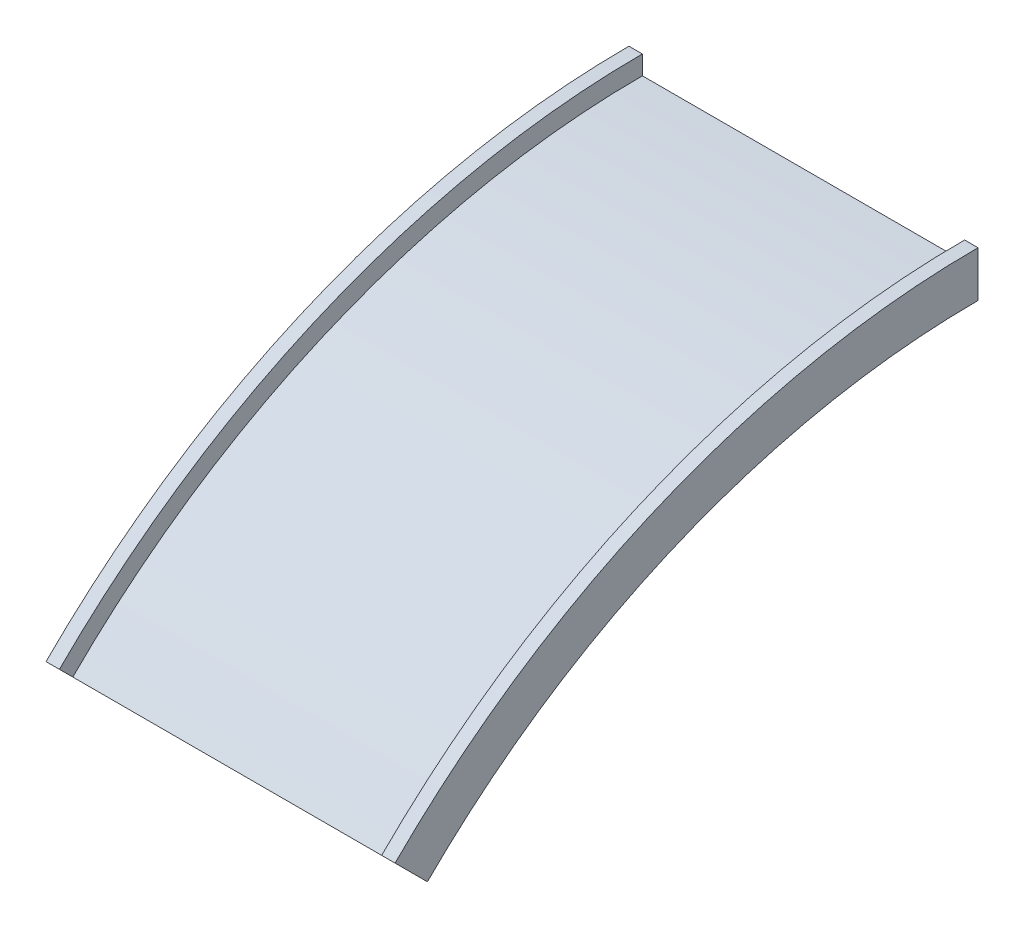
ISO-10303-21;
HEADER;
FILE_DESCRIPTION(('STEP AP214'),'2;1');
FILE_NAME('part.step','',(''),(''),'','','');
FILE_SCHEMA(('AUTOMOTIVE_DESIGN { 1 0 10303 214 1 1 1 1 }'));
ENDSEC;
DATA;
#1=APPLICATION_CONTEXT('core data for automotive mechanical design processes');
#2=APPLICATION_PROTOCOL_DEFINITION('international standard','automotive_design',2000,#1);
#3=PRODUCT_CONTEXT('',#1,'mechanical');
#4=PRODUCT('Part','Part','',(#3));
#5=PRODUCT_RELATED_PRODUCT_CATEGORY('part','',(#4));
#6=PRODUCT_DEFINITION_FORMATION('','',#4);
#7=PRODUCT_DEFINITION_CONTEXT('part definition',#1,'design');
#8=PRODUCT_DEFINITION('design','',#6,#7);
#9=PRODUCT_DEFINITION_SHAPE('','',#8);
#10=(LENGTH_UNIT() NAMED_UNIT(*) SI_UNIT(.MILLI.,.METRE.));
#11=(NAMED_UNIT(*) PLANE_ANGLE_UNIT() SI_UNIT($,.RADIAN.));
#12=(NAMED_UNIT(*) SI_UNIT($,.STERADIAN.) SOLID_ANGLE_UNIT());
#13=UNCERTAINTY_MEASURE_WITH_UNIT(LENGTH_MEASURE(1.E-05),#10,'distance_accuracy_value','');
#14=(GEOMETRIC_REPRESENTATION_CONTEXT(3) GLOBAL_UNCERTAINTY_ASSIGNED_CONTEXT((#13)) GLOBAL_UNIT_ASSIGNED_CONTEXT((#10,
#11,#12)) REPRESENTATION_CONTEXT('',''));
#15=CARTESIAN_POINT('',(0.,0.,0.));
#16=DIRECTION('',(0.,0.,1.));
#17=DIRECTION('',(1.,0.,0.));
#18=AXIS2_PLACEMENT_3D('',#15,#16,#17);
#19=CARTESIAN_POINT('',(25.,-449.660237621641,1085.57584412607));
#20=DIRECTION('',(1.,0.,0.));
#21=DIRECTION('',(0.,0.,-1.));
#22=AXIS2_PLACEMENT_3D('',#19,#20,#21);
#23=PLANE('',#22);
#24=CARTESIAN_POINT('',(25.,-1535.23608174771,0.));
#25=DIRECTION('',(-1.,0.,0.));
#26=DIRECTION('',(0.,0.,1.));
#27=AXIS2_PLACEMENT_3D('',#24,#25,#26);
#28=CIRCLE('',#27,1535.23608174771);
#29=CARTESIAN_POINT('',(25.,-449.660237621641,1085.57584412607));
#30=VERTEX_POINT('',#29);
#31=CARTESIAN_POINT('',(25.,0.,0.));
#32=VERTEX_POINT('',#31);
#33=EDGE_CURVE('E11',#30,#32,#28,.T.);
#34=ORIENTED_EDGE('',*,*,#33,.F.);
#35=DIRECTION('',(0.,-0.707106781186546,-0.707106781186549));
#36=VECTOR('',#35,1.);
#37=CARTESIAN_POINT('',(25.,-449.660237621641,1085.57584412607));
#38=LINE('',#37,#36);
#39=CARTESIAN_POINT('',(25.,-474.57590996789,1060.66017177982));
#40=VERTEX_POINT('',#39);
#41=EDGE_CURVE('E98',#30,#40,#38,.T.);
#42=ORIENTED_EDGE('',*,*,#41,.T.);
#43=CARTESIAN_POINT('',(25.,-1535.23608174771,0.));
#44=DIRECTION('',(-1.,0.,0.));
#45=DIRECTION('',(0.,0.,1.));
#46=AXIS2_PLACEMENT_3D('',#43,#44,#45);
#47=CIRCLE('',#46,1500.);
#48=CARTESIAN_POINT('',(25.,-35.2360817477097,0.));
#49=VERTEX_POINT('',#48);
#50=EDGE_CURVE('E93',#40,#49,#47,.T.);
#51=ORIENTED_EDGE('',*,*,#50,.T.);
#52=DIRECTION('',(0.,-1.,0.));
#53=VECTOR('',#52,1.);
#54=CARTESIAN_POINT('',(25.,0.,0.));
#55=LINE('',#54,#53);
#56=EDGE_CURVE('E96',#32,#49,#55,.T.);
#57=ORIENTED_EDGE('',*,*,#56,.F.);
#58=EDGE_LOOP('',(#34,#42,#51,#57));
#59=FACE_BOUND('',#58,.T.);
#60=ADVANCED_FACE('F33',(#59),#23,.T.);
#61=CARTESIAN_POINT('',(0.,-1535.23608174771,0.));
#62=DIRECTION('',(-1.,0.,0.));
#63=DIRECTION('',(0.,0.,1.));
#64=AXIS2_PLACEMENT_3D('',#61,#62,#63);
#65=CYLINDRICAL_SURFACE('',#64,1535.23608174771);
#66=CARTESIAN_POINT('',(0.,-1535.23608174771,0.));
#67=DIRECTION('',(-1.,0.,0.));
#68=DIRECTION('',(0.,0.,1.));
#69=AXIS2_PLACEMENT_3D('',#66,#67,#68);
#70=CIRCLE('',#69,1535.23608174771);
#71=CARTESIAN_POINT('',(0.,-449.660237621641,1085.57584412607));
#72=VERTEX_POINT('',#71);
#73=CARTESIAN_POINT('',(0.,0.,0.));
#74=VERTEX_POINT('',#73);
#75=EDGE_CURVE('E41',#72,#74,#70,.T.);
#76=ORIENTED_EDGE('',*,*,#75,.F.);
#77=DIRECTION('',(1.,0.,0.));
#78=VECTOR('',#77,1.);
#79=CARTESIAN_POINT('',(0.,-449.660237621641,1085.57584412607));
#80=LINE('',#79,#78);
#81=EDGE_CURVE('E103',#72,#30,#80,.T.);
#82=ORIENTED_EDGE('',*,*,#81,.T.);
#83=ORIENTED_EDGE('',*,*,#33,.T.);
#84=DIRECTION('',(1.,0.,0.));
#85=VECTOR('',#84,1.);
#86=CARTESIAN_POINT('',(0.,0.,0.));
#87=LINE('',#86,#85);
#88=EDGE_CURVE('E116',#74,#32,#87,.T.);
#89=ORIENTED_EDGE('',*,*,#88,.F.);
#90=EDGE_LOOP('',(#76,#82,#83,#89));
#91=FACE_BOUND('',#90,.T.);
#92=ADVANCED_FACE('F35',(#91),#65,.T.);
#93=CARTESIAN_POINT('',(0.,-509.931249027217,1025.3048327205));
#94=DIRECTION('',(-1.,0.,0.));
#95=DIRECTION('',(0.,0.,1.));
#96=AXIS2_PLACEMENT_3D('',#93,#94,#95);
#97=PLANE('',#96);
#98=CARTESIAN_POINT('',(0.,-1535.23608174771,0.));
#99=DIRECTION('',(-1.,0.,0.));
#100=DIRECTION('',(0.,0.,1.));
#101=AXIS2_PLACEMENT_3D('',#98,#99,#100);
#102=CIRCLE('',#101,1450.);
#103=CARTESIAN_POINT('',(0.,-509.931249027217,1025.3048327205));
#104=VERTEX_POINT('',#103);
#105=CARTESIAN_POINT('',(0.,-85.2360817477096,0.));
#106=VERTEX_POINT('',#105);
#107=EDGE_CURVE('E157',#104,#106,#102,.T.);
#108=ORIENTED_EDGE('',*,*,#107,.F.);
#109=DIRECTION('',(0.,0.707106781186546,0.707106781186549));
#110=VECTOR('',#109,1.);
#111=CARTESIAN_POINT('',(0.,-509.931249027217,1025.3048327205));
#112=LINE('',#111,#110);
#113=EDGE_CURVE('E147',#104,#72,#112,.T.);
#114=ORIENTED_EDGE('',*,*,#113,.T.);
#115=ORIENTED_EDGE('',*,*,#75,.T.);
#116=DIRECTION('',(0.,1.,0.));
#117=VECTOR('',#116,1.);
#118=CARTESIAN_POINT('',(0.,-85.2360817477096,0.));
#119=LINE('',#118,#117);
#120=EDGE_CURVE('E129',#106,#74,#119,.T.);
#121=ORIENTED_EDGE('',*,*,#120,.F.);
#122=EDGE_LOOP('',(#108,#114,#115,#121));
#123=FACE_BOUND('',#122,.T.);
#124=ADVANCED_FACE('F160',(#123),#97,.T.);
#125=CARTESIAN_POINT('',(0.,-1535.23608174771,0.));
#126=DIRECTION('',(-1.,0.,0.));
#127=DIRECTION('',(0.,0.,1.));
#128=AXIS2_PLACEMENT_3D('',#125,#126,#127);
#129=CYLINDRICAL_SURFACE('',#128,1450.);
#130=CARTESIAN_POINT('',(650.,-1535.23608174771,0.));
#131=DIRECTION('',(-1.,0.,0.));
#132=DIRECTION('',(0.,0.,1.));
#133=AXIS2_PLACEMENT_3D('',#130,#131,#132);
#134=CIRCLE('',#133,1450.);
#135=CARTESIAN_POINT('',(650.,-509.931249027218,1025.3048327205));
#136=VERTEX_POINT('',#135);
#137=CARTESIAN_POINT('',(650.,-85.2360817477097,0.));
#138=VERTEX_POINT('',#137);
#139=EDGE_CURVE('E155',#136,#138,#134,.T.);
#140=ORIENTED_EDGE('',*,*,#139,.F.);
#141=DIRECTION('',(-1.,0.,0.));
#142=VECTOR('',#141,1.);
#143=CARTESIAN_POINT('',(650.,-509.931249027218,1025.3048327205));
#144=LINE('',#143,#142);
#145=EDGE_CURVE('E144',#136,#104,#144,.T.);
#146=ORIENTED_EDGE('',*,*,#145,.T.);
#147=ORIENTED_EDGE('',*,*,#107,.T.);
#148=DIRECTION('',(-1.,0.,0.));
#149=VECTOR('',#148,1.);
#150=CARTESIAN_POINT('',(650.,-85.2360817477097,0.));
#151=LINE('',#150,#149);
#152=EDGE_CURVE('E126',#138,#106,#151,.T.);
#153=ORIENTED_EDGE('',*,*,#152,.F.);
#154=EDGE_LOOP('',(#140,#146,#147,#153));
#155=FACE_BOUND('',#154,.T.);
#156=ADVANCED_FACE('F179',(#155),#129,.F.);
#157=CARTESIAN_POINT('',(650.,-449.660237621641,1085.57584412607));
#158=DIRECTION('',(1.,0.,0.));
#159=DIRECTION('',(0.,0.,-1.));
#160=AXIS2_PLACEMENT_3D('',#157,#158,#159);
#161=PLANE('',#160);
#162=CARTESIAN_POINT('',(650.,-1535.23608174771,0.));
#163=DIRECTION('',(-1.,0.,0.));
#164=DIRECTION('',(0.,0.,1.));
#165=AXIS2_PLACEMENT_3D('',#162,#163,#164);
#166=CIRCLE('',#165,1535.23608174771);
#167=CARTESIAN_POINT('',(650.,-449.660237621641,1085.57584412607));
#168=VERTEX_POINT('',#167);
#169=CARTESIAN_POINT('',(650.,0.,0.));
#170=VERTEX_POINT('',#169);
#171=EDGE_CURVE('E153',#168,#170,#166,.T.);
#172=ORIENTED_EDGE('',*,*,#171,.F.);
#173=DIRECTION('',(0.,-0.707106781186546,-0.707106781186549));
#174=VECTOR('',#173,1.);
#175=CARTESIAN_POINT('',(650.,-449.660237621641,1085.57584412607));
#176=LINE('',#175,#174);
#177=EDGE_CURVE('E141',#168,#136,#176,.T.);
#178=ORIENTED_EDGE('',*,*,#177,.T.);
#179=ORIENTED_EDGE('',*,*,#139,.T.);
#180=DIRECTION('',(0.,-1.,0.));
#181=VECTOR('',#180,1.);
#182=CARTESIAN_POINT('',(650.,0.,0.));
#183=LINE('',#182,#181);
#184=EDGE_CURVE('E123',#170,#138,#183,.T.);
#185=ORIENTED_EDGE('',*,*,#184,.F.);
#186=EDGE_LOOP('',(#172,#178,#179,#185));
#187=FACE_BOUND('',#186,.T.);
#188=ADVANCED_FACE('F176',(#187),#161,.T.);
#189=CARTESIAN_POINT('',(0.,-1535.23608174771,0.));
#190=DIRECTION('',(-1.,0.,0.));
#191=DIRECTION('',(0.,0.,1.));
#192=AXIS2_PLACEMENT_3D('',#189,#190,#191);
#193=CYLINDRICAL_SURFACE('',#192,1535.23608174771);
#194=CARTESIAN_POINT('',(625.,-1535.23608174771,0.));
#195=DIRECTION('',(-1.,0.,0.));
#196=DIRECTION('',(0.,0.,1.));
#197=AXIS2_PLACEMENT_3D('',#194,#195,#196);
#198=CIRCLE('',#197,1535.23608174771);
#199=CARTESIAN_POINT('',(625.,-449.660237621641,1085.57584412607));
#200=VERTEX_POINT('',#199);
#201=CARTESIAN_POINT('',(625.,0.,0.));
#202=VERTEX_POINT('',#201);
#203=EDGE_CURVE('E151',#200,#202,#198,.T.);
#204=ORIENTED_EDGE('',*,*,#203,.F.);
#205=DIRECTION('',(1.,0.,0.));
#206=VECTOR('',#205,1.);
#207=CARTESIAN_POINT('',(625.,-449.660237621641,1085.57584412607));
#208=LINE('',#207,#206);
#209=EDGE_CURVE('E138',#200,#168,#208,.T.);
#210=ORIENTED_EDGE('',*,*,#209,.T.);
#211=ORIENTED_EDGE('',*,*,#171,.T.);
#212=DIRECTION('',(1.,0.,0.));
#213=VECTOR('',#212,1.);
#214=CARTESIAN_POINT('',(625.,0.,0.));
#215=LINE('',#214,#213);
#216=EDGE_CURVE('E120',#202,#170,#215,.T.);
#217=ORIENTED_EDGE('',*,*,#216,.F.);
#218=EDGE_LOOP('',(#204,#210,#211,#217));
#219=FACE_BOUND('',#218,.T.);
#220=ADVANCED_FACE('F174',(#219),#193,.T.);
#221=CARTESIAN_POINT('',(625.,-474.57590996789,1060.66017177982));
#222=DIRECTION('',(-1.,0.,0.));
#223=DIRECTION('',(0.,0.,1.));
#224=AXIS2_PLACEMENT_3D('',#221,#222,#223);
#225=PLANE('',#224);
#226=CARTESIAN_POINT('',(625.,-1535.23608174771,0.));
#227=DIRECTION('',(-1.,0.,0.));
#228=DIRECTION('',(0.,0.,1.));
#229=AXIS2_PLACEMENT_3D('',#226,#227,#228);
#230=CIRCLE('',#229,1500.);
#231=CARTESIAN_POINT('',(625.,-474.57590996789,1060.66017177982));
#232=VERTEX_POINT('',#231);
#233=CARTESIAN_POINT('',(625.,-35.2360817477097,0.));
#234=VERTEX_POINT('',#233);
#235=EDGE_CURVE('E102',#232,#234,#230,.T.);
#236=ORIENTED_EDGE('',*,*,#235,.F.);
#237=DIRECTION('',(0.,0.707106781186546,0.707106781186549));
#238=VECTOR('',#237,1.);
#239=CARTESIAN_POINT('',(625.,-474.57590996789,1060.66017177982));
#240=LINE('',#239,#238);
#241=EDGE_CURVE('E135',#232,#200,#240,.T.);
#242=ORIENTED_EDGE('',*,*,#241,.T.);
#243=ORIENTED_EDGE('',*,*,#203,.T.);
#244=DIRECTION('',(0.,1.,0.));
#245=VECTOR('',#244,1.);
#246=CARTESIAN_POINT('',(625.,-35.2360817477097,0.));
#247=LINE('',#246,#245);
#248=EDGE_CURVE('E111',#234,#202,#247,.T.);
#249=ORIENTED_EDGE('',*,*,#248,.F.);
#250=EDGE_LOOP('',(#236,#242,#243,#249));
#251=FACE_BOUND('',#250,.T.);
#252=ADVANCED_FACE('F170',(#251),#225,.T.);
#253=CARTESIAN_POINT('',(0.,-1535.23608174771,0.));
#254=DIRECTION('',(-1.,0.,0.));
#255=DIRECTION('',(0.,0.,1.));
#256=AXIS2_PLACEMENT_3D('',#253,#254,#255);
#257=CYLINDRICAL_SURFACE('',#256,1500.);
#258=DIRECTION('',(1.,0.,0.));
#259=VECTOR('',#258,1.);
#260=CARTESIAN_POINT('',(25.,-474.57590996789,1060.66017177982));
#261=LINE('',#260,#259);
#262=EDGE_CURVE('E133',#40,#232,#261,.T.);
#263=ORIENTED_EDGE('',*,*,#262,.T.);
#264=ORIENTED_EDGE('',*,*,#235,.T.);
#265=DIRECTION('',(1.,0.,0.));
#266=VECTOR('',#265,1.);
#267=CARTESIAN_POINT('',(25.,-35.2360817477097,0.));
#268=LINE('',#267,#266);
#269=EDGE_CURVE('E106',#49,#234,#268,.T.);
#270=ORIENTED_EDGE('',*,*,#269,.F.);
#271=ORIENTED_EDGE('',*,*,#50,.F.);
#272=EDGE_LOOP('',(#263,#264,#270,#271));
#273=FACE_BOUND('',#272,.T.);
#274=ADVANCED_FACE('F107',(#273),#257,.T.);
#275=CARTESIAN_POINT('',(0.,-449.660237621641,1085.57584412607));
#276=DIRECTION('',(0.,-0.707106781186549,0.707106781186546));
#277=DIRECTION('',(1.,0.,0.));
#278=AXIS2_PLACEMENT_3D('',#275,#276,#277);
#279=PLANE('',#278);
#280=ORIENTED_EDGE('',*,*,#41,.F.);
#281=ORIENTED_EDGE('',*,*,#81,.F.);
#282=ORIENTED_EDGE('',*,*,#113,.F.);
#283=ORIENTED_EDGE('',*,*,#145,.F.);
#284=ORIENTED_EDGE('',*,*,#177,.F.);
#285=ORIENTED_EDGE('',*,*,#209,.F.);
#286=ORIENTED_EDGE('',*,*,#241,.F.);
#287=ORIENTED_EDGE('',*,*,#262,.F.);
#288=EDGE_LOOP('',(#280,#281,#282,#283,#284,#285,#286,#287));
#289=FACE_BOUND('',#288,.T.);
#290=ADVANCED_FACE('F165',(#289),#279,.T.);
#291=CARTESIAN_POINT('',(0.,0.,0.));
#292=DIRECTION('',(0.,0.,1.));
#293=DIRECTION('',(1.,0.,0.));
#294=AXIS2_PLACEMENT_3D('',#291,#292,#293);
#295=PLANE('',#294);
#296=ORIENTED_EDGE('',*,*,#56,.T.);
#297=ORIENTED_EDGE('',*,*,#269,.T.);
#298=ORIENTED_EDGE('',*,*,#248,.T.);
#299=ORIENTED_EDGE('',*,*,#216,.T.);
#300=ORIENTED_EDGE('',*,*,#184,.T.);
#301=ORIENTED_EDGE('',*,*,#152,.T.);
#302=ORIENTED_EDGE('',*,*,#120,.T.);
#303=ORIENTED_EDGE('',*,*,#88,.T.);
#304=EDGE_LOOP('',(#296,#297,#298,#299,#300,#301,#302,#303));
#305=FACE_BOUND('',#304,.T.);
#306=ADVANCED_FACE('F114',(#305),#295,.F.);
#307=CLOSED_SHELL('',(#60,#92,#124,#156,#188,#220,#252,#274,#290,#306));
#308=MANIFOLD_SOLID_BREP('B2',#307);
#309=ADVANCED_BREP_SHAPE_REPRESENTATION('',(#18,#308),#14);
#310=SHAPE_DEFINITION_REPRESENTATION(#9,#309);
ENDSEC;
END-ISO-10303-21;
